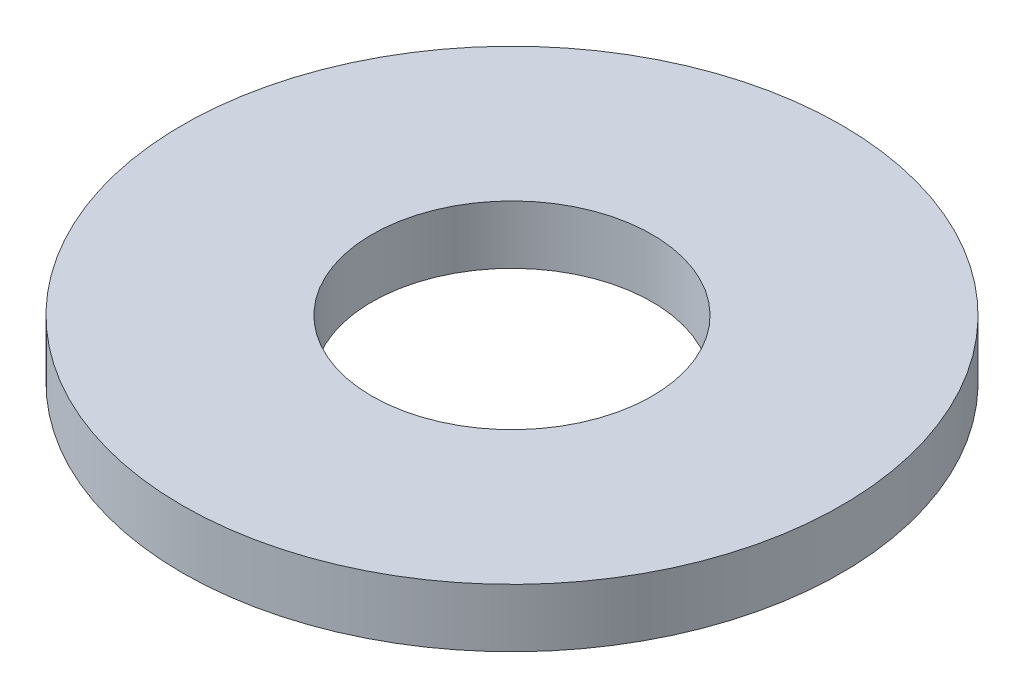
ISO-10303-21;
HEADER;
FILE_DESCRIPTION(('STEP AP214'),'2;1');
FILE_NAME('part.step','',(''),(''),'','','');
FILE_SCHEMA(('AUTOMOTIVE_DESIGN { 1 0 10303 214 1 1 1 1 }'));
ENDSEC;
DATA;
#1=APPLICATION_CONTEXT('core data for automotive mechanical design processes');
#2=APPLICATION_PROTOCOL_DEFINITION('international standard','automotive_design',2000,#1);
#3=PRODUCT_CONTEXT('',#1,'mechanical');
#4=PRODUCT('Part','Part','',(#3));
#5=PRODUCT_RELATED_PRODUCT_CATEGORY('part','',(#4));
#6=PRODUCT_DEFINITION_FORMATION('','',#4);
#7=PRODUCT_DEFINITION_CONTEXT('part definition',#1,'design');
#8=PRODUCT_DEFINITION('design','',#6,#7);
#9=PRODUCT_DEFINITION_SHAPE('','',#8);
#10=(LENGTH_UNIT() NAMED_UNIT(*) SI_UNIT(.MILLI.,.METRE.));
#11=(NAMED_UNIT(*) PLANE_ANGLE_UNIT() SI_UNIT($,.RADIAN.));
#12=(NAMED_UNIT(*) SI_UNIT($,.STERADIAN.) SOLID_ANGLE_UNIT());
#13=UNCERTAINTY_MEASURE_WITH_UNIT(LENGTH_MEASURE(1.E-05),#10,'distance_accuracy_value','');
#14=(GEOMETRIC_REPRESENTATION_CONTEXT(3) GLOBAL_UNCERTAINTY_ASSIGNED_CONTEXT((#13)) GLOBAL_UNIT_ASSIGNED_CONTEXT((#10,
#11,#12)) REPRESENTATION_CONTEXT('',''));
#15=CARTESIAN_POINT('',(0.,0.,0.));
#16=DIRECTION('',(0.,0.,1.));
#17=DIRECTION('',(1.,0.,0.));
#18=AXIS2_PLACEMENT_3D('',#15,#16,#17);
#19=CARTESIAN_POINT('',(0.,1.651,0.));
#20=DIRECTION('',(0.,1.,0.));
#21=DIRECTION('',(0.,0.,1.));
#22=AXIS2_PLACEMENT_3D('',#19,#20,#21);
#23=PLANE('',#22);
#24=CARTESIAN_POINT('',(0.,1.651,0.));
#25=DIRECTION('',(0.,1.,0.));
#26=DIRECTION('',(0.,0.,1.));
#27=AXIS2_PLACEMENT_3D('',#24,#25,#26);
#28=CIRCLE('',#27,9.3218);
#29=CARTESIAN_POINT('',(0.,1.651,9.3218));
#30=VERTEX_POINT('',#29);
#31=EDGE_CURVE('E10',#30,#30,#28,.T.);
#32=ORIENTED_EDGE('',*,*,#31,.T.);
#33=EDGE_LOOP('',(#32));
#34=FACE_BOUND('',#33,.T.);
#35=CARTESIAN_POINT('',(0.,1.651,0.));
#36=DIRECTION('',(0.,1.,0.));
#37=DIRECTION('',(0.,0.,1.));
#38=AXIS2_PLACEMENT_3D('',#35,#36,#37);
#39=CIRCLE('',#38,3.9624);
#40=CARTESIAN_POINT('',(0.,1.651,3.9624));
#41=VERTEX_POINT('',#40);
#42=EDGE_CURVE('E42',#41,#41,#39,.T.);
#43=ORIENTED_EDGE('',*,*,#42,.F.);
#44=EDGE_LOOP('',(#43));
#45=FACE_BOUND('',#44,.T.);
#46=ADVANCED_FACE('F31',(#34,#45),#23,.T.);
#47=CARTESIAN_POINT('',(0.,0.,0.));
#48=DIRECTION('',(0.,1.,0.));
#49=DIRECTION('',(0.,0.,1.));
#50=AXIS2_PLACEMENT_3D('',#47,#48,#49);
#51=PLANE('',#50);
#52=CARTESIAN_POINT('',(0.,0.,0.));
#53=DIRECTION('',(0.,1.,0.));
#54=DIRECTION('',(0.,0.,1.));
#55=AXIS2_PLACEMENT_3D('',#52,#53,#54);
#56=CIRCLE('',#55,9.3218);
#57=CARTESIAN_POINT('',(0.,0.,9.3218));
#58=VERTEX_POINT('',#57);
#59=EDGE_CURVE('E35',#58,#58,#56,.T.);
#60=ORIENTED_EDGE('',*,*,#59,.F.);
#61=EDGE_LOOP('',(#60));
#62=FACE_BOUND('',#61,.T.);
#63=CARTESIAN_POINT('',(0.,0.,0.));
#64=DIRECTION('',(0.,1.,0.));
#65=DIRECTION('',(0.,0.,1.));
#66=AXIS2_PLACEMENT_3D('',#63,#64,#65);
#67=CIRCLE('',#66,3.9624);
#68=CARTESIAN_POINT('',(0.,0.,3.9624));
#69=VERTEX_POINT('',#68);
#70=EDGE_CURVE('E44',#69,#69,#67,.T.);
#71=ORIENTED_EDGE('',*,*,#70,.T.);
#72=EDGE_LOOP('',(#71));
#73=FACE_BOUND('',#72,.T.);
#74=ADVANCED_FACE('F54',(#62,#73),#51,.F.);
#75=CARTESIAN_POINT('',(0.,1.651,0.));
#76=DIRECTION('',(0.,-1.,0.));
#77=DIRECTION('',(0.,0.,-1.));
#78=AXIS2_PLACEMENT_3D('',#75,#76,#77);
#79=CYLINDRICAL_SURFACE('',#78,9.3218);
#80=ORIENTED_EDGE('',*,*,#31,.F.);
#81=EDGE_LOOP('',(#80));
#82=FACE_BOUND('',#81,.T.);
#83=ORIENTED_EDGE('',*,*,#59,.T.);
#84=EDGE_LOOP('',(#83));
#85=FACE_BOUND('',#84,.T.);
#86=ADVANCED_FACE('F33',(#82,#85),#79,.T.);
#87=CARTESIAN_POINT('',(0.,1.651,0.));
#88=DIRECTION('',(0.,-1.,0.));
#89=DIRECTION('',(0.,0.,-1.));
#90=AXIS2_PLACEMENT_3D('',#87,#88,#89);
#91=CYLINDRICAL_SURFACE('',#90,3.9624);
#92=ORIENTED_EDGE('',*,*,#42,.T.);
#93=EDGE_LOOP('',(#92));
#94=FACE_BOUND('',#93,.T.);
#95=ORIENTED_EDGE('',*,*,#70,.F.);
#96=EDGE_LOOP('',(#95));
#97=FACE_BOUND('',#96,.T.);
#98=ADVANCED_FACE('F50',(#94,#97),#91,.F.);
#99=CLOSED_SHELL('',(#46,#74,#86,#98));
#100=MANIFOLD_SOLID_BREP('B2',#99);
#101=ADVANCED_BREP_SHAPE_REPRESENTATION('',(#18,#100),#14);
#102=SHAPE_DEFINITION_REPRESENTATION(#9,#101);
ENDSEC;
END-ISO-10303-21;
